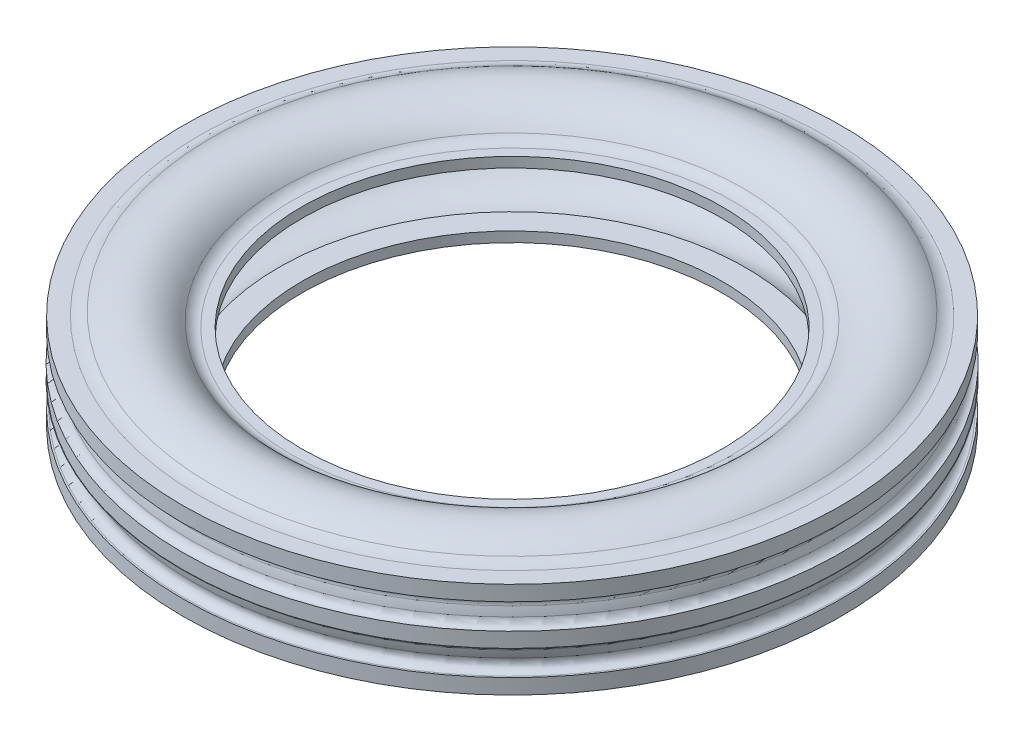
ISO-10303-21;
HEADER;
FILE_DESCRIPTION(('STEP AP214'),'2;1');
FILE_NAME('part.step','',(''),(''),'','','');
FILE_SCHEMA(('AUTOMOTIVE_DESIGN { 1 0 10303 214 1 1 1 1 }'));
ENDSEC;
DATA;
#1=APPLICATION_CONTEXT('core data for automotive mechanical design processes');
#2=APPLICATION_PROTOCOL_DEFINITION('international standard','automotive_design',2000,#1);
#3=PRODUCT_CONTEXT('',#1,'mechanical');
#4=PRODUCT('Part','Part','',(#3));
#5=PRODUCT_RELATED_PRODUCT_CATEGORY('part','',(#4));
#6=PRODUCT_DEFINITION_FORMATION('','',#4);
#7=PRODUCT_DEFINITION_CONTEXT('part definition',#1,'design');
#8=PRODUCT_DEFINITION('design','',#6,#7);
#9=PRODUCT_DEFINITION_SHAPE('','',#8);
#10=(LENGTH_UNIT() NAMED_UNIT(*) SI_UNIT(.MILLI.,.METRE.));
#11=(NAMED_UNIT(*) PLANE_ANGLE_UNIT() SI_UNIT($,.RADIAN.));
#12=(NAMED_UNIT(*) SI_UNIT($,.STERADIAN.) SOLID_ANGLE_UNIT());
#13=UNCERTAINTY_MEASURE_WITH_UNIT(LENGTH_MEASURE(1.E-05),#10,'distance_accuracy_value','');
#14=(GEOMETRIC_REPRESENTATION_CONTEXT(3) GLOBAL_UNCERTAINTY_ASSIGNED_CONTEXT((#13)) GLOBAL_UNIT_ASSIGNED_CONTEXT((#10,
#11,#12)) REPRESENTATION_CONTEXT('',''));
#15=CARTESIAN_POINT('',(0.,0.,0.));
#16=DIRECTION('',(0.,0.,1.));
#17=DIRECTION('',(1.,0.,0.));
#18=AXIS2_PLACEMENT_3D('',#15,#16,#17);
#19=CARTESIAN_POINT('',(0.,67.5000000000523,0.));
#20=DIRECTION('',(0.,1.,0.));
#21=DIRECTION('',(0.,0.,1.));
#22=AXIS2_PLACEMENT_3D('',#19,#20,#21);
#23=TOROIDAL_SURFACE('',#22,309.324931941992,20.0000000000799);
#24=CARTESIAN_POINT('',(0.,47.4999999999568,0.));
#25=DIRECTION('',(0.,1.,0.));
#26=DIRECTION('',(0.,0.,1.));
#27=AXIS2_PLACEMENT_3D('',#24,#25,#26);
#28=CIRCLE('',#27,309.324931941992);
#29=CARTESIAN_POINT('',(0.,47.4999999999568,309.324931941992));
#30=VERTEX_POINT('',#29);
#31=EDGE_CURVE('E126',#30,#30,#28,.T.);
#32=ORIENTED_EDGE('',*,*,#31,.T.);
#33=EDGE_LOOP('',(#32));
#34=FACE_BOUND('',#33,.T.);
#35=CARTESIAN_POINT('',(0.,51.3571428571665,0.));
#36=DIRECTION('',(0.,1.,0.));
#37=DIRECTION('',(0.,0.,1.));
#38=AXIS2_PLACEMENT_3D('',#35,#36,#37);
#39=CIRCLE('',#38,297.517808529951);
#40=CARTESIAN_POINT('',(0.,51.3571428571665,297.517808529951));
#41=VERTEX_POINT('',#40);
#42=EDGE_CURVE('E10',#41,#41,#39,.T.);
#43=ORIENTED_EDGE('',*,*,#42,.F.);
#44=EDGE_LOOP('',(#43));
#45=FACE_BOUND('',#44,.T.);
#46=ADVANCED_FACE('F32',(#34,#45),#23,.F.);
#47=CARTESIAN_POINT('',(0.,11.0000000000241,0.));
#48=DIRECTION('',(0.,1.,0.));
#49=DIRECTION('',(0.,0.,1.));
#50=AXIS2_PLACEMENT_3D('',#47,#48,#49);
#51=TOROIDAL_SURFACE('',#50,268.,50.0000000000262);
#52=ORIENTED_EDGE('',*,*,#42,.T.);
#53=EDGE_LOOP('',(#52));
#54=FACE_BOUND('',#53,.T.);
#55=CARTESIAN_POINT('',(0.,42.2500000000275,0.));
#56=DIRECTION('',(0.,1.,0.));
#57=DIRECTION('',(0.,0.,1.));
#58=AXIS2_PLACEMENT_3D('',#55,#56,#57);
#59=CIRCLE('',#58,228.968762509979);
#60=CARTESIAN_POINT('',(0.,42.2500000000275,228.968762509979));
#61=VERTEX_POINT('',#60);
#62=EDGE_CURVE('E38',#61,#61,#59,.T.);
#63=ORIENTED_EDGE('',*,*,#62,.F.);
#64=EDGE_LOOP('',(#63));
#65=FACE_BOUND('',#64,.T.);
#66=ADVANCED_FACE('F144',(#54,#65),#51,.T.);
#67=CARTESIAN_POINT('',(0.,50.9999999999877,0.));
#68=DIRECTION('',(0.,1.,0.));
#69=DIRECTION('',(0.,0.,1.));
#70=AXIS2_PLACEMENT_3D('',#67,#68,#69);
#71=TOROIDAL_SURFACE('',#70,218.040016012775,13.9999999999979);
#72=ORIENTED_EDGE('',*,*,#62,.T.);
#73=EDGE_LOOP('',(#72));
#74=FACE_BOUND('',#73,.T.);
#75=CARTESIAN_POINT('',(0.,36.9999999999898,0.));
#76=DIRECTION('',(0.,1.,0.));
#77=DIRECTION('',(0.,0.,1.));
#78=AXIS2_PLACEMENT_3D('',#75,#76,#77);
#79=CIRCLE('',#78,218.040016012775);
#80=CARTESIAN_POINT('',(0.,36.9999999999898,218.040016012775));
#81=VERTEX_POINT('',#80);
#82=EDGE_CURVE('E42',#81,#81,#79,.T.);
#83=ORIENTED_EDGE('',*,*,#82,.F.);
#84=EDGE_LOOP('',(#83));
#85=FACE_BOUND('',#84,.T.);
#86=ADVANCED_FACE('F148',(#74,#85),#71,.F.);
#87=CARTESIAN_POINT('',(208.,36.9999999999838,0.));
#88=DIRECTION('',(0.,1.,0.));
#89=DIRECTION('',(0.,0.,1.));
#90=AXIS2_PLACEMENT_3D('',#87,#88,#89);
#91=PLANE('',#90);
#92=ORIENTED_EDGE('',*,*,#82,.T.);
#93=EDGE_LOOP('',(#92));
#94=FACE_BOUND('',#93,.T.);
#95=CARTESIAN_POINT('',(0.,36.9999999999777,0.));
#96=DIRECTION('',(0.,1.,0.));
#97=DIRECTION('',(0.,0.,1.));
#98=AXIS2_PLACEMENT_3D('',#95,#96,#97);
#99=CIRCLE('',#98,208.);
#100=CARTESIAN_POINT('',(0.,36.9999999999777,208.));
#101=VERTEX_POINT('',#100);
#102=EDGE_CURVE('E46',#101,#101,#99,.T.);
#103=ORIENTED_EDGE('',*,*,#102,.F.);
#104=EDGE_LOOP('',(#103));
#105=FACE_BOUND('',#104,.T.);
#106=ADVANCED_FACE('F152',(#94,#105),#91,.T.);
#107=CARTESIAN_POINT('',(0.,-30.9999999999491,0.));
#108=DIRECTION('',(0.,1.,0.));
#109=DIRECTION('',(0.,0.,1.));
#110=AXIS2_PLACEMENT_3D('',#107,#108,#109);
#111=CYLINDRICAL_SURFACE('',#110,208.);
#112=ORIENTED_EDGE('',*,*,#102,.T.);
#113=EDGE_LOOP('',(#112));
#114=FACE_BOUND('',#113,.T.);
#115=CARTESIAN_POINT('',(0.,26.9999999999868,0.));
#116=DIRECTION('',(0.,1.,0.));
#117=DIRECTION('',(0.,0.,1.));
#118=AXIS2_PLACEMENT_3D('',#115,#116,#117);
#119=CIRCLE('',#118,208.);
#120=CARTESIAN_POINT('',(0.,26.9999999999868,208.));
#121=VERTEX_POINT('',#120);
#122=EDGE_CURVE('E51',#121,#121,#119,.T.);
#123=ORIENTED_EDGE('',*,*,#122,.F.);
#124=EDGE_LOOP('',(#123));
#125=FACE_BOUND('',#124,.T.);
#126=ADVANCED_FACE('F158',(#114,#125),#111,.F.);
#127=CARTESIAN_POINT('',(231.339394440337,26.9999999999868,0.));
#128=DIRECTION('',(0.,-1.,0.));
#129=DIRECTION('',(0.,0.,-1.));
#130=AXIS2_PLACEMENT_3D('',#127,#128,#129);
#131=PLANE('',#130);
#132=ORIENTED_EDGE('',*,*,#122,.T.);
#133=EDGE_LOOP('',(#132));
#134=FACE_BOUND('',#133,.T.);
#135=CARTESIAN_POINT('',(0.,26.9999999999868,0.));
#136=DIRECTION('',(0.,1.,0.));
#137=DIRECTION('',(0.,0.,1.));
#138=AXIS2_PLACEMENT_3D('',#135,#136,#137);
#139=CIRCLE('',#138,231.339394440337);
#140=CARTESIAN_POINT('',(0.,26.9999999999868,231.339394440337));
#141=VERTEX_POINT('',#140);
#142=EDGE_CURVE('E54',#141,#141,#139,.T.);
#143=ORIENTED_EDGE('',*,*,#142,.F.);
#144=EDGE_LOOP('',(#143));
#145=FACE_BOUND('',#144,.T.);
#146=ADVANCED_FACE('F162',(#134,#145),#131,.T.);
#147=CARTESIAN_POINT('',(0.,11.0000000000241,0.));
#148=DIRECTION('',(0.,1.,0.));
#149=DIRECTION('',(0.,0.,1.));
#150=AXIS2_PLACEMENT_3D('',#147,#148,#149);
#151=TOROIDAL_SURFACE('',#150,268.,39.9999999999968);
#152=ORIENTED_EDGE('',*,*,#142,.T.);
#153=EDGE_LOOP('',(#152));
#154=FACE_BOUND('',#153,.T.);
#155=CARTESIAN_POINT('',(0.,19.7999999999758,0.));
#156=DIRECTION('',(0.,1.,0.));
#157=DIRECTION('',(0.,0.,1.));
#158=AXIS2_PLACEMENT_3D('',#155,#156,#157);
#159=CIRCLE('',#158,307.019994874431);
#160=CARTESIAN_POINT('',(0.,19.7999999999758,307.019994874431));
#161=VERTEX_POINT('',#160);
#162=EDGE_CURVE('E57',#161,#161,#159,.T.);
#163=ORIENTED_EDGE('',*,*,#162,.F.);
#164=EDGE_LOOP('',(#163));
#165=FACE_BOUND('',#164,.T.);
#166=ADVANCED_FACE('F166',(#154,#165),#151,.F.);
#167=CARTESIAN_POINT('',(0.,0.,0.));
#168=DIRECTION('',(0.,1.,0.));
#169=DIRECTION('',(0.,0.,1.));
#170=AXIS2_PLACEMENT_3D('',#167,#168,#169);
#171=TOROIDAL_SURFACE('',#170,234.68079388353,75.0000000000033);
#172=ORIENTED_EDGE('',*,*,#162,.T.);
#173=EDGE_LOOP('',(#172));
#174=FACE_BOUND('',#173,.T.);
#175=CARTESIAN_POINT('',(0.,-19.7999999999752,0.));
#176=DIRECTION('',(0.,1.,0.));
#177=DIRECTION('',(0.,0.,1.));
#178=AXIS2_PLACEMENT_3D('',#175,#176,#177);
#179=CIRCLE('',#178,307.019994874428);
#180=CARTESIAN_POINT('',(0.,-19.7999999999752,307.019994874428));
#181=VERTEX_POINT('',#180);
#182=EDGE_CURVE('E60',#181,#181,#179,.T.);
#183=ORIENTED_EDGE('',*,*,#182,.F.);
#184=EDGE_LOOP('',(#183));
#185=FACE_BOUND('',#184,.T.);
#186=ADVANCED_FACE('F170',(#174,#185),#171,.F.);
#187=CARTESIAN_POINT('',(0.,-11.0000000000241,0.));
#188=DIRECTION('',(0.,1.,0.));
#189=DIRECTION('',(0.,0.,1.));
#190=AXIS2_PLACEMENT_3D('',#187,#188,#189);
#191=TOROIDAL_SURFACE('',#190,268.,39.9999999999968);
#192=ORIENTED_EDGE('',*,*,#182,.T.);
#193=EDGE_LOOP('',(#192));
#194=FACE_BOUND('',#193,.T.);
#195=CARTESIAN_POINT('',(0.,-26.9999999999856,0.));
#196=DIRECTION('',(0.,1.,0.));
#197=DIRECTION('',(0.,0.,1.));
#198=AXIS2_PLACEMENT_3D('',#195,#196,#197);
#199=CIRCLE('',#198,231.33939444034);
#200=CARTESIAN_POINT('',(0.,-26.9999999999856,231.33939444034));
#201=VERTEX_POINT('',#200);
#202=EDGE_CURVE('E63',#201,#201,#199,.T.);
#203=ORIENTED_EDGE('',*,*,#202,.F.);
#204=EDGE_LOOP('',(#203));
#205=FACE_BOUND('',#204,.T.);
#206=ADVANCED_FACE('F174',(#194,#205),#191,.F.);
#207=CARTESIAN_POINT('',(208.,-26.9999999999862,0.));
#208=DIRECTION('',(0.,1.,0.));
#209=DIRECTION('',(0.,0.,1.));
#210=AXIS2_PLACEMENT_3D('',#207,#208,#209);
#211=PLANE('',#210);
#212=ORIENTED_EDGE('',*,*,#202,.T.);
#213=EDGE_LOOP('',(#212));
#214=FACE_BOUND('',#213,.T.);
#215=CARTESIAN_POINT('',(0.,-26.9999999999868,0.));
#216=DIRECTION('',(0.,1.,0.));
#217=DIRECTION('',(0.,0.,1.));
#218=AXIS2_PLACEMENT_3D('',#215,#216,#217);
#219=CIRCLE('',#218,208.);
#220=CARTESIAN_POINT('',(0.,-26.9999999999868,208.));
#221=VERTEX_POINT('',#220);
#222=EDGE_CURVE('E66',#221,#221,#219,.T.);
#223=ORIENTED_EDGE('',*,*,#222,.F.);
#224=EDGE_LOOP('',(#223));
#225=FACE_BOUND('',#224,.T.);
#226=ADVANCED_FACE('F178',(#214,#225),#211,.T.);
#227=CARTESIAN_POINT('',(0.,-30.9999999999491,0.));
#228=DIRECTION('',(0.,1.,0.));
#229=DIRECTION('',(0.,0.,1.));
#230=AXIS2_PLACEMENT_3D('',#227,#228,#229);
#231=CYLINDRICAL_SURFACE('',#230,208.);
#232=ORIENTED_EDGE('',*,*,#222,.T.);
#233=EDGE_LOOP('',(#232));
#234=FACE_BOUND('',#233,.T.);
#235=CARTESIAN_POINT('',(0.,-36.9999999999777,0.));
#236=DIRECTION('',(0.,1.,0.));
#237=DIRECTION('',(0.,0.,1.));
#238=AXIS2_PLACEMENT_3D('',#235,#236,#237);
#239=CIRCLE('',#238,208.);
#240=CARTESIAN_POINT('',(0.,-36.9999999999777,208.));
#241=VERTEX_POINT('',#240);
#242=EDGE_CURVE('E69',#241,#241,#239,.T.);
#243=ORIENTED_EDGE('',*,*,#242,.F.);
#244=EDGE_LOOP('',(#243));
#245=FACE_BOUND('',#244,.T.);
#246=ADVANCED_FACE('F182',(#234,#245),#231,.F.);
#247=CARTESIAN_POINT('',(218.040016012775,-36.9999999999777,0.));
#248=DIRECTION('',(0.,-1.,0.));
#249=DIRECTION('',(0.,0.,-1.));
#250=AXIS2_PLACEMENT_3D('',#247,#248,#249);
#251=PLANE('',#250);
#252=ORIENTED_EDGE('',*,*,#242,.T.);
#253=EDGE_LOOP('',(#252));
#254=FACE_BOUND('',#253,.T.);
#255=CARTESIAN_POINT('',(0.,-36.9999999999777,0.));
#256=DIRECTION('',(0.,1.,0.));
#257=DIRECTION('',(0.,0.,1.));
#258=AXIS2_PLACEMENT_3D('',#255,#256,#257);
#259=CIRCLE('',#258,218.040016012775);
#260=CARTESIAN_POINT('',(0.,-36.9999999999777,218.040016012775));
#261=VERTEX_POINT('',#260);
#262=EDGE_CURVE('E72',#261,#261,#259,.T.);
#263=ORIENTED_EDGE('',*,*,#262,.F.);
#264=EDGE_LOOP('',(#263));
#265=FACE_BOUND('',#264,.T.);
#266=ADVANCED_FACE('F186',(#254,#265),#251,.T.);
#267=CARTESIAN_POINT('',(0.,-50.9999999999877,0.));
#268=DIRECTION('',(0.,1.,0.));
#269=DIRECTION('',(0.,0.,1.));
#270=AXIS2_PLACEMENT_3D('',#267,#268,#269);
#271=TOROIDAL_SURFACE('',#270,218.040016012775,13.9999999999979);
#272=ORIENTED_EDGE('',*,*,#262,.T.);
#273=EDGE_LOOP('',(#272));
#274=FACE_BOUND('',#273,.T.);
#275=CARTESIAN_POINT('',(0.,-42.2500000000165,0.));
#276=DIRECTION('',(0.,1.,0.));
#277=DIRECTION('',(0.,0.,1.));
#278=AXIS2_PLACEMENT_3D('',#275,#276,#277);
#279=CIRCLE('',#278,228.968762509993);
#280=CARTESIAN_POINT('',(0.,-42.2500000000165,228.968762509993));
#281=VERTEX_POINT('',#280);
#282=EDGE_CURVE('E75',#281,#281,#279,.T.);
#283=ORIENTED_EDGE('',*,*,#282,.F.);
#284=EDGE_LOOP('',(#283));
#285=FACE_BOUND('',#284,.T.);
#286=ADVANCED_FACE('F190',(#274,#285),#271,.F.);
#287=CARTESIAN_POINT('',(0.,-11.0000000000241,0.));
#288=DIRECTION('',(0.,1.,0.));
#289=DIRECTION('',(0.,0.,1.));
#290=AXIS2_PLACEMENT_3D('',#287,#288,#289);
#291=TOROIDAL_SURFACE('',#290,268.,50.0000000000262);
#292=ORIENTED_EDGE('',*,*,#282,.T.);
#293=EDGE_LOOP('',(#292));
#294=FACE_BOUND('',#293,.T.);
#295=CARTESIAN_POINT('',(0.,-51.3571428571665,0.));
#296=DIRECTION('',(0.,1.,0.));
#297=DIRECTION('',(0.,0.,1.));
#298=AXIS2_PLACEMENT_3D('',#295,#296,#297);
#299=CIRCLE('',#298,297.517808529951);
#300=CARTESIAN_POINT('',(0.,-51.3571428571665,297.517808529951));
#301=VERTEX_POINT('',#300);
#302=EDGE_CURVE('E78',#301,#301,#299,.T.);
#303=ORIENTED_EDGE('',*,*,#302,.F.);
#304=EDGE_LOOP('',(#303));
#305=FACE_BOUND('',#304,.T.);
#306=ADVANCED_FACE('F194',(#294,#305),#291,.T.);
#307=CARTESIAN_POINT('',(0.,-67.5000000000523,0.));
#308=DIRECTION('',(0.,1.,0.));
#309=DIRECTION('',(0.,0.,1.));
#310=AXIS2_PLACEMENT_3D('',#307,#308,#309);
#311=TOROIDAL_SURFACE('',#310,309.324931941992,20.0000000000799);
#312=ORIENTED_EDGE('',*,*,#302,.T.);
#313=EDGE_LOOP('',(#312));
#314=FACE_BOUND('',#313,.T.);
#315=CARTESIAN_POINT('',(0.,-47.4999999999724,0.));
#316=DIRECTION('',(0.,1.,0.));
#317=DIRECTION('',(0.,0.,1.));
#318=AXIS2_PLACEMENT_3D('',#315,#316,#317);
#319=CIRCLE('',#318,309.324931941992);
#320=CARTESIAN_POINT('',(0.,-47.4999999999724,309.324931941992));
#321=VERTEX_POINT('',#320);
#322=EDGE_CURVE('E81',#321,#321,#319,.T.);
#323=ORIENTED_EDGE('',*,*,#322,.F.);
#324=EDGE_LOOP('',(#323));
#325=FACE_BOUND('',#324,.T.);
#326=ADVANCED_FACE('F198',(#314,#325),#311,.F.);
#327=CARTESIAN_POINT('',(326.,-47.4999999999646,0.));
#328=DIRECTION('',(0.,-1.,0.));
#329=DIRECTION('',(0.,0.,-1.));
#330=AXIS2_PLACEMENT_3D('',#327,#328,#329);
#331=PLANE('',#330);
#332=ORIENTED_EDGE('',*,*,#322,.T.);
#333=EDGE_LOOP('',(#332));
#334=FACE_BOUND('',#333,.T.);
#335=CARTESIAN_POINT('',(0.,-47.4999999999568,0.));
#336=DIRECTION('',(0.,1.,0.));
#337=DIRECTION('',(0.,0.,1.));
#338=AXIS2_PLACEMENT_3D('',#335,#336,#337);
#339=CIRCLE('',#338,326.);
#340=CARTESIAN_POINT('',(0.,-47.4999999999568,326.));
#341=VERTEX_POINT('',#340);
#342=EDGE_CURVE('E84',#341,#341,#339,.T.);
#343=ORIENTED_EDGE('',*,*,#342,.F.);
#344=EDGE_LOOP('',(#343));
#345=FACE_BOUND('',#344,.T.);
#346=ADVANCED_FACE('F202',(#334,#345),#331,.T.);
#347=CARTESIAN_POINT('',(0.,-30.9999999999491,0.));
#348=DIRECTION('',(0.,1.,0.));
#349=DIRECTION('',(0.,0.,1.));
#350=AXIS2_PLACEMENT_3D('',#347,#348,#349);
#351=CYLINDRICAL_SURFACE('',#350,326.);
#352=ORIENTED_EDGE('',*,*,#342,.T.);
#353=EDGE_LOOP('',(#352));
#354=FACE_BOUND('',#353,.T.);
#355=CARTESIAN_POINT('',(0.,-32.4999999999704,0.));
#356=DIRECTION('',(0.,1.,0.));
#357=DIRECTION('',(0.,0.,1.));
#358=AXIS2_PLACEMENT_3D('',#355,#356,#357);
#359=CIRCLE('',#358,326.);
#360=CARTESIAN_POINT('',(0.,-32.4999999999704,326.));
#361=VERTEX_POINT('',#360);
#362=EDGE_CURVE('E87',#361,#361,#359,.T.);
#363=ORIENTED_EDGE('',*,*,#362,.F.);
#364=EDGE_LOOP('',(#363));
#365=FACE_BOUND('',#364,.T.);
#366=ADVANCED_FACE('F206',(#354,#365),#351,.T.);
#367=CARTESIAN_POINT('',(324.39560936014,-32.4999999999704,0.));
#368=DIRECTION('',(0.,1.,0.));
#369=DIRECTION('',(0.,0.,1.));
#370=AXIS2_PLACEMENT_3D('',#367,#368,#369);
#371=PLANE('',#370);
#372=ORIENTED_EDGE('',*,*,#362,.T.);
#373=EDGE_LOOP('',(#372));
#374=FACE_BOUND('',#373,.T.);
#375=CARTESIAN_POINT('',(0.,-32.4999999999704,0.));
#376=DIRECTION('',(0.,1.,0.));
#377=DIRECTION('',(0.,0.,1.));
#378=AXIS2_PLACEMENT_3D('',#375,#376,#377);
#379=CIRCLE('',#378,324.39560936014);
#380=CARTESIAN_POINT('',(0.,-32.4999999999704,324.39560936014));
#381=VERTEX_POINT('',#380);
#382=EDGE_CURVE('E90',#381,#381,#379,.T.);
#383=ORIENTED_EDGE('',*,*,#382,.F.);
#384=EDGE_LOOP('',(#383));
#385=FACE_BOUND('',#384,.T.);
#386=ADVANCED_FACE('F210',(#374,#385),#371,.T.);
#387=CARTESIAN_POINT('',(0.,-24.5000074902464,0.));
#388=DIRECTION('',(0.,1.,0.));
#389=DIRECTION('',(0.,0.,1.));
#390=AXIS2_PLACEMENT_3D('',#387,#388,#389);
#391=TOROIDAL_SURFACE('',#390,324.39560936014,7.99999250973689);
#392=ORIENTED_EDGE('',*,*,#382,.T.);
#393=EDGE_LOOP('',(#392));
#394=FACE_BOUND('',#393,.T.);
#395=CARTESIAN_POINT('',(0.,-22.3924817526074,0.));
#396=DIRECTION('',(0.,1.,0.));
#397=DIRECTION('',(0.,0.,1.));
#398=AXIS2_PLACEMENT_3D('',#395,#396,#397);
#399=CIRCLE('',#398,316.678212427169);
#400=CARTESIAN_POINT('',(0.,-22.3924817526074,316.678212427169));
#401=VERTEX_POINT('',#400);
#402=EDGE_CURVE('E93',#401,#401,#399,.T.);
#403=ORIENTED_EDGE('',*,*,#402,.F.);
#404=EDGE_LOOP('',(#403));
#405=FACE_BOUND('',#404,.T.);
#406=ADVANCED_FACE('F214',(#394,#405),#391,.F.);
#407=CARTESIAN_POINT('',(0.,0.,0.));
#408=DIRECTION('',(0.,1.,0.));
#409=DIRECTION('',(0.,0.,1.));
#410=AXIS2_PLACEMENT_3D('',#407,#408,#409);
#411=TOROIDAL_SURFACE('',#410,234.68079388353,84.9999993344666);
#412=ORIENTED_EDGE('',*,*,#402,.T.);
#413=EDGE_LOOP('',(#412));
#414=FACE_BOUND('',#413,.T.);
#415=CARTESIAN_POINT('',(0.,-14.1666572987447,0.));
#416=DIRECTION('',(0.,1.,0.));
#417=DIRECTION('',(0.,0.,1.));
#418=AXIS2_PLACEMENT_3D('',#415,#416,#417);
#419=CIRCLE('',#418,318.491925052601);
#420=CARTESIAN_POINT('',(0.,-14.1666572987447,318.491925052601));
#421=VERTEX_POINT('',#420);
#422=EDGE_CURVE('E96',#421,#421,#419,.T.);
#423=ORIENTED_EDGE('',*,*,#422,.F.);
#424=EDGE_LOOP('',(#423));
#425=FACE_BOUND('',#424,.T.);
#426=ADVANCED_FACE('F218',(#414,#425),#411,.T.);
#427=CARTESIAN_POINT('',(0.,-15.499988512488,0.));
#428=DIRECTION('',(0.,1.,0.));
#429=DIRECTION('',(0.,0.,1.));
#430=AXIS2_PLACEMENT_3D('',#427,#428,#429);
#431=TOROIDAL_SURFACE('',#430,326.380024191844,7.99999051109413);
#432=ORIENTED_EDGE('',*,*,#422,.T.);
#433=EDGE_LOOP('',(#432));
#434=FACE_BOUND('',#433,.T.);
#435=CARTESIAN_POINT('',(0.,-7.49999800139389,0.));
#436=DIRECTION('',(0.,1.,0.));
#437=DIRECTION('',(0.,0.,1.));
#438=AXIS2_PLACEMENT_3D('',#435,#436,#437);
#439=CIRCLE('',#438,326.380024191844);
#440=CARTESIAN_POINT('',(0.,-7.49999800139389,326.380024191844));
#441=VERTEX_POINT('',#440);
#442=EDGE_CURVE('E99',#441,#441,#439,.T.);
#443=ORIENTED_EDGE('',*,*,#442,.F.);
#444=EDGE_LOOP('',(#443));
#445=FACE_BOUND('',#444,.T.);
#446=ADVANCED_FACE('F222',(#434,#445),#431,.F.);
#447=CARTESIAN_POINT('',(326.,-7.49999900069353,0.));
#448=DIRECTION('',(0.,1.,0.));
#449=DIRECTION('',(0.,0.,1.));
#450=AXIS2_PLACEMENT_3D('',#447,#448,#449);
#451=PLANE('',#450);
#452=ORIENTED_EDGE('',*,*,#442,.T.);
#453=EDGE_LOOP('',(#452));
#454=FACE_BOUND('',#453,.T.);
#455=CARTESIAN_POINT('',(0.,-7.49999999999318,0.));
#456=DIRECTION('',(0.,1.,0.));
#457=DIRECTION('',(0.,0.,1.));
#458=AXIS2_PLACEMENT_3D('',#455,#456,#457);
#459=CIRCLE('',#458,326.);
#460=CARTESIAN_POINT('',(0.,-7.49999999999318,326.));
#461=VERTEX_POINT('',#460);
#462=EDGE_CURVE('E102',#461,#461,#459,.T.);
#463=ORIENTED_EDGE('',*,*,#462,.F.);
#464=EDGE_LOOP('',(#463));
#465=FACE_BOUND('',#464,.T.);
#466=ADVANCED_FACE('F226',(#454,#465),#451,.T.);
#467=CARTESIAN_POINT('',(0.,-30.9999999999491,0.));
#468=DIRECTION('',(0.,1.,0.));
#469=DIRECTION('',(0.,0.,1.));
#470=AXIS2_PLACEMENT_3D('',#467,#468,#469);
#471=CYLINDRICAL_SURFACE('',#470,326.);
#472=ORIENTED_EDGE('',*,*,#462,.T.);
#473=EDGE_LOOP('',(#472));
#474=FACE_BOUND('',#473,.T.);
#475=CARTESIAN_POINT('',(0.,7.49999999999318,0.));
#476=DIRECTION('',(0.,1.,0.));
#477=DIRECTION('',(0.,0.,1.));
#478=AXIS2_PLACEMENT_3D('',#475,#476,#477);
#479=CIRCLE('',#478,326.);
#480=CARTESIAN_POINT('',(0.,7.49999999999318,326.));
#481=VERTEX_POINT('',#480);
#482=EDGE_CURVE('E105',#481,#481,#479,.T.);
#483=ORIENTED_EDGE('',*,*,#482,.F.);
#484=EDGE_LOOP('',(#483));
#485=FACE_BOUND('',#484,.T.);
#486=ADVANCED_FACE('F230',(#474,#485),#471,.T.);
#487=CARTESIAN_POINT('',(326.380024191844,7.5000000000216,0.));
#488=DIRECTION('',(0.,-1.,0.));
#489=DIRECTION('',(0.,0.,-1.));
#490=AXIS2_PLACEMENT_3D('',#487,#488,#489);
#491=PLANE('',#490);
#492=ORIENTED_EDGE('',*,*,#482,.T.);
#493=EDGE_LOOP('',(#492));
#494=FACE_BOUND('',#493,.T.);
#495=CARTESIAN_POINT('',(0.,7.50000000005002,0.));
#496=DIRECTION('',(0.,1.,0.));
#497=DIRECTION('',(0.,0.,1.));
#498=AXIS2_PLACEMENT_3D('',#495,#496,#497);
#499=CIRCLE('',#498,326.380024191844);
#500=CARTESIAN_POINT('',(0.,7.50000000005002,326.380024191844));
#501=VERTEX_POINT('',#500);
#502=EDGE_CURVE('E108',#501,#501,#499,.T.);
#503=ORIENTED_EDGE('',*,*,#502,.F.);
#504=EDGE_LOOP('',(#503));
#505=FACE_BOUND('',#504,.T.);
#506=ADVANCED_FACE('F234',(#494,#505),#491,.T.);
#507=CARTESIAN_POINT('',(0.,15.499988512488,0.));
#508=DIRECTION('',(0.,1.,0.));
#509=DIRECTION('',(0.,0.,1.));
#510=AXIS2_PLACEMENT_3D('',#507,#508,#509);
#511=TOROIDAL_SURFACE('',#510,326.380024191844,7.99999051109413);
#512=ORIENTED_EDGE('',*,*,#502,.T.);
#513=EDGE_LOOP('',(#512));
#514=FACE_BOUND('',#513,.T.);
#515=CARTESIAN_POINT('',(0.,14.1666576318538,0.));
#516=DIRECTION('',(0.,1.,0.));
#517=DIRECTION('',(0.,0.,1.));
#518=AXIS2_PLACEMENT_3D('',#515,#516,#517);
#519=CIRCLE('',#518,318.491927023303);
#520=CARTESIAN_POINT('',(0.,14.1666576318538,318.491927023303));
#521=VERTEX_POINT('',#520);
#522=EDGE_CURVE('E111',#521,#521,#519,.T.);
#523=ORIENTED_EDGE('',*,*,#522,.F.);
#524=EDGE_LOOP('',(#523));
#525=FACE_BOUND('',#524,.T.);
#526=ADVANCED_FACE('F238',(#514,#525),#511,.F.);
#527=CARTESIAN_POINT('',(0.,0.,0.));
#528=DIRECTION('',(0.,1.,0.));
#529=DIRECTION('',(0.,0.,1.));
#530=AXIS2_PLACEMENT_3D('',#527,#528,#529);
#531=TOROIDAL_SURFACE('',#530,234.68079388353,84.9999993344666);
#532=ORIENTED_EDGE('',*,*,#522,.T.);
#533=EDGE_LOOP('',(#532));
#534=FACE_BOUND('',#533,.T.);
#535=CARTESIAN_POINT('',(0.,22.3924817526039,0.));
#536=DIRECTION('',(0.,1.,0.));
#537=DIRECTION('',(0.,0.,1.));
#538=AXIS2_PLACEMENT_3D('',#535,#536,#537);
#539=CIRCLE('',#538,316.678212427156);
#540=CARTESIAN_POINT('',(0.,22.3924817526039,316.678212427156));
#541=VERTEX_POINT('',#540);
#542=EDGE_CURVE('E114',#541,#541,#539,.T.);
#543=ORIENTED_EDGE('',*,*,#542,.F.);
#544=EDGE_LOOP('',(#543));
#545=FACE_BOUND('',#544,.T.);
#546=ADVANCED_FACE('F242',(#534,#545),#531,.T.);
#547=CARTESIAN_POINT('',(0.,24.5000074902464,0.));
#548=DIRECTION('',(0.,1.,0.));
#549=DIRECTION('',(0.,0.,1.));
#550=AXIS2_PLACEMENT_3D('',#547,#548,#549);
#551=TOROIDAL_SURFACE('',#550,324.39560936014,7.99999250976531);
#552=ORIENTED_EDGE('',*,*,#542,.T.);
#553=EDGE_LOOP('',(#552));
#554=FACE_BOUND('',#553,.T.);
#555=CARTESIAN_POINT('',(0.,32.5000000000117,0.));
#556=DIRECTION('',(0.,1.,0.));
#557=DIRECTION('',(0.,0.,1.));
#558=AXIS2_PLACEMENT_3D('',#555,#556,#557);
#559=CIRCLE('',#558,324.39560936014);
#560=CARTESIAN_POINT('',(0.,32.5000000000117,324.39560936014));
#561=VERTEX_POINT('',#560);
#562=EDGE_CURVE('E117',#561,#561,#559,.T.);
#563=ORIENTED_EDGE('',*,*,#562,.F.);
#564=EDGE_LOOP('',(#563));
#565=FACE_BOUND('',#564,.T.);
#566=ADVANCED_FACE('F246',(#554,#565),#551,.F.);
#567=CARTESIAN_POINT('',(326.,32.5000000000195,0.));
#568=DIRECTION('',(0.,-1.,0.));
#569=DIRECTION('',(0.,0.,-1.));
#570=AXIS2_PLACEMENT_3D('',#567,#568,#569);
#571=PLANE('',#570);
#572=ORIENTED_EDGE('',*,*,#562,.T.);
#573=EDGE_LOOP('',(#572));
#574=FACE_BOUND('',#573,.T.);
#575=CARTESIAN_POINT('',(0.,32.5000000000273,0.));
#576=DIRECTION('',(0.,1.,0.));
#577=DIRECTION('',(0.,0.,1.));
#578=AXIS2_PLACEMENT_3D('',#575,#576,#577);
#579=CIRCLE('',#578,326.);
#580=CARTESIAN_POINT('',(0.,32.5000000000273,326.));
#581=VERTEX_POINT('',#580);
#582=EDGE_CURVE('E120',#581,#581,#579,.T.);
#583=ORIENTED_EDGE('',*,*,#582,.F.);
#584=EDGE_LOOP('',(#583));
#585=FACE_BOUND('',#584,.T.);
#586=ADVANCED_FACE('F140',(#574,#585),#571,.T.);
#587=CARTESIAN_POINT('',(0.,-30.9999999999491,0.));
#588=DIRECTION('',(0.,1.,0.));
#589=DIRECTION('',(0.,0.,1.));
#590=AXIS2_PLACEMENT_3D('',#587,#588,#589);
#591=CYLINDRICAL_SURFACE('',#590,326.);
#592=ORIENTED_EDGE('',*,*,#582,.T.);
#593=EDGE_LOOP('',(#592));
#594=FACE_BOUND('',#593,.T.);
#595=CARTESIAN_POINT('',(0.,47.4999999999568,0.));
#596=DIRECTION('',(0.,1.,0.));
#597=DIRECTION('',(0.,0.,1.));
#598=AXIS2_PLACEMENT_3D('',#595,#596,#597);
#599=CIRCLE('',#598,326.);
#600=CARTESIAN_POINT('',(0.,47.4999999999568,326.));
#601=VERTEX_POINT('',#600);
#602=EDGE_CURVE('E123',#601,#601,#599,.T.);
#603=ORIENTED_EDGE('',*,*,#602,.F.);
#604=EDGE_LOOP('',(#603));
#605=FACE_BOUND('',#604,.T.);
#606=ADVANCED_FACE('F134',(#594,#605),#591,.T.);
#607=CARTESIAN_POINT('',(309.324931941992,47.4999999999568,0.));
#608=DIRECTION('',(0.,1.,0.));
#609=DIRECTION('',(0.,0.,1.));
#610=AXIS2_PLACEMENT_3D('',#607,#608,#609);
#611=PLANE('',#610);
#612=ORIENTED_EDGE('',*,*,#602,.T.);
#613=EDGE_LOOP('',(#612));
#614=FACE_BOUND('',#613,.T.);
#615=ORIENTED_EDGE('',*,*,#31,.F.);
#616=EDGE_LOOP('',(#615));
#617=FACE_BOUND('',#616,.T.);
#618=ADVANCED_FACE('F132',(#614,#617),#611,.T.);
#619=CLOSED_SHELL('',(#46,#66,#86,#106,#126,#146,#166,#186,#206,#226,#246,#266,#286,#306,#326,
#346,#366,#386,#406,#426,#446,#466,#486,#506,#526,#546,#566,#586,#606,#618));
#620=MANIFOLD_SOLID_BREP('B2',#619);
#621=ADVANCED_BREP_SHAPE_REPRESENTATION('',(#18,#620),#14);
#622=SHAPE_DEFINITION_REPRESENTATION(#9,#621);
ENDSEC;
END-ISO-10303-21;
